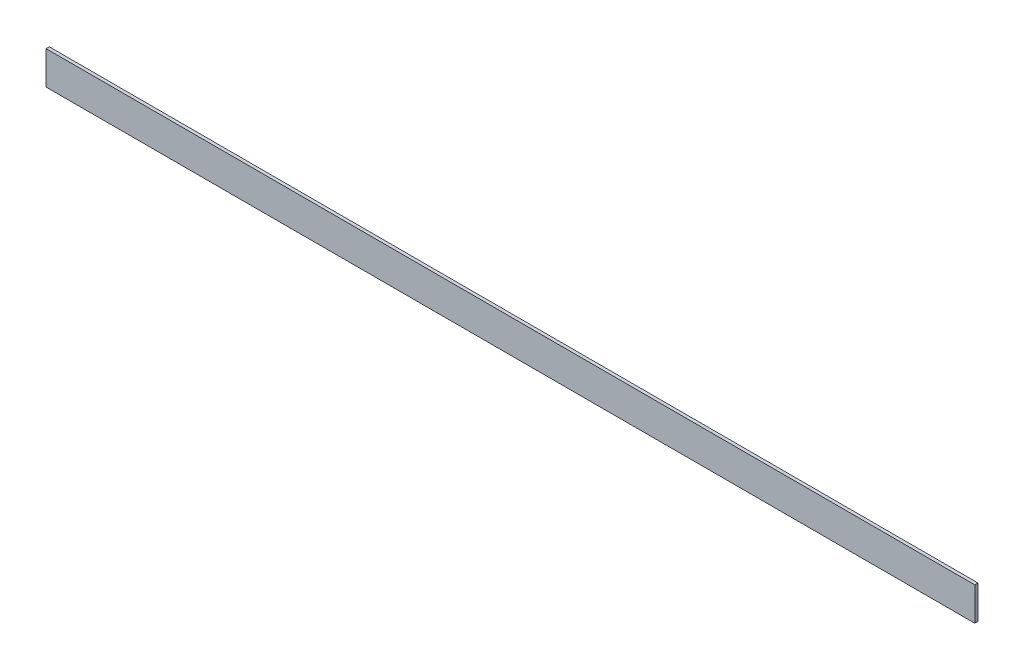
ISO-10303-21;
HEADER;
FILE_DESCRIPTION(('STEP AP214'),'2;1');
FILE_NAME('part.step','',(''),(''),'','','');
FILE_SCHEMA(('AUTOMOTIVE_DESIGN { 1 0 10303 214 1 1 1 1 }'));
ENDSEC;
DATA;
#1=APPLICATION_CONTEXT('core data for automotive mechanical design processes');
#2=APPLICATION_PROTOCOL_DEFINITION('international standard','automotive_design',2000,#1);
#3=PRODUCT_CONTEXT('',#1,'mechanical');
#4=PRODUCT('Part','Part','',(#3));
#5=PRODUCT_RELATED_PRODUCT_CATEGORY('part','',(#4));
#6=PRODUCT_DEFINITION_FORMATION('','',#4);
#7=PRODUCT_DEFINITION_CONTEXT('part definition',#1,'design');
#8=PRODUCT_DEFINITION('design','',#6,#7);
#9=PRODUCT_DEFINITION_SHAPE('','',#8);
#10=(LENGTH_UNIT() NAMED_UNIT(*) SI_UNIT(.MILLI.,.METRE.));
#11=(NAMED_UNIT(*) PLANE_ANGLE_UNIT() SI_UNIT($,.RADIAN.));
#12=(NAMED_UNIT(*) SI_UNIT($,.STERADIAN.) SOLID_ANGLE_UNIT());
#13=UNCERTAINTY_MEASURE_WITH_UNIT(LENGTH_MEASURE(1.E-05),#10,'distance_accuracy_value','');
#14=(GEOMETRIC_REPRESENTATION_CONTEXT(3) GLOBAL_UNCERTAINTY_ASSIGNED_CONTEXT((#13)) GLOBAL_UNIT_ASSIGNED_CONTEXT((#10,
#11,#12)) REPRESENTATION_CONTEXT('',''));
#15=CARTESIAN_POINT('',(0.,0.,0.));
#16=DIRECTION('',(0.,0.,1.));
#17=DIRECTION('',(1.,0.,0.));
#18=AXIS2_PLACEMENT_3D('',#15,#16,#17);
#19=CARTESIAN_POINT('',(0.,0.,3.175));
#20=DIRECTION('',(1.,0.,0.));
#21=DIRECTION('',(0.,0.,-1.));
#22=AXIS2_PLACEMENT_3D('',#19,#20,#21);
#23=PLANE('',#22);
#24=DIRECTION('',(0.,-1.,0.));
#25=VECTOR('',#24,1.);
#26=CARTESIAN_POINT('',(0.,0.,0.));
#27=LINE('',#26,#25);
#28=CARTESIAN_POINT('',(0.,33.,0.));
#29=VERTEX_POINT('',#28);
#30=CARTESIAN_POINT('',(0.,0.,0.));
#31=VERTEX_POINT('',#30);
#32=EDGE_CURVE('E96',#29,#31,#27,.T.);
#33=ORIENTED_EDGE('',*,*,#32,.T.);
#34=DIRECTION('',(0.,0.,-1.));
#35=VECTOR('',#34,1.);
#36=CARTESIAN_POINT('',(0.,0.,3.175));
#37=LINE('',#36,#35);
#38=CARTESIAN_POINT('',(0.,0.,3.175));
#39=VERTEX_POINT('',#38);
#40=EDGE_CURVE('E11',#39,#31,#37,.T.);
#41=ORIENTED_EDGE('',*,*,#40,.F.);
#42=DIRECTION('',(0.,-1.,0.));
#43=VECTOR('',#42,1.);
#44=CARTESIAN_POINT('',(0.,0.,3.175));
#45=LINE('',#44,#43);
#46=CARTESIAN_POINT('',(0.,33.,3.175));
#47=VERTEX_POINT('',#46);
#48=EDGE_CURVE('E84',#47,#39,#45,.T.);
#49=ORIENTED_EDGE('',*,*,#48,.F.);
#50=DIRECTION('',(0.,0.,-1.));
#51=VECTOR('',#50,1.);
#52=CARTESIAN_POINT('',(0.,33.,3.175));
#53=LINE('',#52,#51);
#54=EDGE_CURVE('E92',#47,#29,#53,.T.);
#55=ORIENTED_EDGE('',*,*,#54,.T.);
#56=EDGE_LOOP('',(#33,#41,#49,#55));
#57=FACE_BOUND('',#56,.T.);
#58=ADVANCED_FACE('F33',(#57),#23,.F.);
#59=CARTESIAN_POINT('',(0.,0.,3.175));
#60=DIRECTION('',(0.,1.,0.));
#61=DIRECTION('',(0.,0.,1.));
#62=AXIS2_PLACEMENT_3D('',#59,#60,#61);
#63=PLANE('',#62);
#64=DIRECTION('',(1.,0.,0.));
#65=VECTOR('',#64,1.);
#66=CARTESIAN_POINT('',(0.,0.,0.));
#67=LINE('',#66,#65);
#68=CARTESIAN_POINT('',(920.75,0.,0.));
#69=VERTEX_POINT('',#68);
#70=EDGE_CURVE('E88',#31,#69,#67,.T.);
#71=ORIENTED_EDGE('',*,*,#70,.T.);
#72=DIRECTION('',(0.,0.,-1.));
#73=VECTOR('',#72,1.);
#74=CARTESIAN_POINT('',(920.75,0.,3.175));
#75=LINE('',#74,#73);
#76=CARTESIAN_POINT('',(920.75,0.,3.175));
#77=VERTEX_POINT('',#76);
#78=EDGE_CURVE('E41',#77,#69,#75,.T.);
#79=ORIENTED_EDGE('',*,*,#78,.F.);
#80=DIRECTION('',(1.,0.,0.));
#81=VECTOR('',#80,1.);
#82=CARTESIAN_POINT('',(0.,0.,3.175));
#83=LINE('',#82,#81);
#84=EDGE_CURVE('E79',#39,#77,#83,.T.);
#85=ORIENTED_EDGE('',*,*,#84,.F.);
#86=ORIENTED_EDGE('',*,*,#40,.T.);
#87=EDGE_LOOP('',(#71,#79,#85,#86));
#88=FACE_BOUND('',#87,.T.);
#89=ADVANCED_FACE('F87',(#88),#63,.F.);
#90=CARTESIAN_POINT('',(920.75,0.,3.175));
#91=DIRECTION('',(-1.,0.,0.));
#92=DIRECTION('',(0.,0.,1.));
#93=AXIS2_PLACEMENT_3D('',#90,#91,#92);
#94=PLANE('',#93);
#95=DIRECTION('',(0.,1.,0.));
#96=VECTOR('',#95,1.);
#97=CARTESIAN_POINT('',(920.75,0.,0.));
#98=LINE('',#97,#96);
#99=CARTESIAN_POINT('',(920.75,33.,0.));
#100=VERTEX_POINT('',#99);
#101=EDGE_CURVE('E66',#69,#100,#98,.T.);
#102=ORIENTED_EDGE('',*,*,#101,.T.);
#103=DIRECTION('',(0.,0.,-1.));
#104=VECTOR('',#103,1.);
#105=CARTESIAN_POINT('',(920.75,33.,3.175));
#106=LINE('',#105,#104);
#107=CARTESIAN_POINT('',(920.75,33.,3.175));
#108=VERTEX_POINT('',#107);
#109=EDGE_CURVE('E89',#108,#100,#106,.T.);
#110=ORIENTED_EDGE('',*,*,#109,.F.);
#111=DIRECTION('',(0.,1.,0.));
#112=VECTOR('',#111,1.);
#113=CARTESIAN_POINT('',(920.75,0.,3.175));
#114=LINE('',#113,#112);
#115=EDGE_CURVE('E82',#77,#108,#114,.T.);
#116=ORIENTED_EDGE('',*,*,#115,.F.);
#117=ORIENTED_EDGE('',*,*,#78,.T.);
#118=EDGE_LOOP('',(#102,#110,#116,#117));
#119=FACE_BOUND('',#118,.T.);
#120=ADVANCED_FACE('F90',(#119),#94,.F.);
#121=CARTESIAN_POINT('',(0.,33.,3.175));
#122=DIRECTION('',(0.,-1.,0.));
#123=DIRECTION('',(0.,0.,-1.));
#124=AXIS2_PLACEMENT_3D('',#121,#122,#123);
#125=PLANE('',#124);
#126=DIRECTION('',(-1.,0.,0.));
#127=VECTOR('',#126,1.);
#128=CARTESIAN_POINT('',(0.,33.,0.));
#129=LINE('',#128,#127);
#130=EDGE_CURVE('E72',#100,#29,#129,.T.);
#131=ORIENTED_EDGE('',*,*,#130,.T.);
#132=ORIENTED_EDGE('',*,*,#54,.F.);
#133=DIRECTION('',(-1.,0.,0.));
#134=VECTOR('',#133,1.);
#135=CARTESIAN_POINT('',(0.,33.,3.175));
#136=LINE('',#135,#134);
#137=EDGE_CURVE('E49',#108,#47,#136,.T.);
#138=ORIENTED_EDGE('',*,*,#137,.F.);
#139=ORIENTED_EDGE('',*,*,#109,.T.);
#140=EDGE_LOOP('',(#131,#132,#138,#139));
#141=FACE_BOUND('',#140,.T.);
#142=ADVANCED_FACE('F103',(#141),#125,.F.);
#143=CARTESIAN_POINT('',(0.,0.,3.175));
#144=DIRECTION('',(0.,0.,-1.));
#145=DIRECTION('',(-1.,0.,0.));
#146=AXIS2_PLACEMENT_3D('',#143,#144,#145);
#147=PLANE('',#146);
#148=ORIENTED_EDGE('',*,*,#48,.T.);
#149=ORIENTED_EDGE('',*,*,#84,.T.);
#150=ORIENTED_EDGE('',*,*,#115,.T.);
#151=ORIENTED_EDGE('',*,*,#137,.T.);
#152=EDGE_LOOP('',(#148,#149,#150,#151));
#153=FACE_BOUND('',#152,.T.);
#154=ADVANCED_FACE('F80',(#153),#147,.F.);
#155=CARTESIAN_POINT('',(0.,0.,0.));
#156=DIRECTION('',(0.,0.,-1.));
#157=DIRECTION('',(-1.,0.,0.));
#158=AXIS2_PLACEMENT_3D('',#155,#156,#157);
#159=PLANE('',#158);
#160=ORIENTED_EDGE('',*,*,#32,.F.);
#161=ORIENTED_EDGE('',*,*,#130,.F.);
#162=ORIENTED_EDGE('',*,*,#101,.F.);
#163=ORIENTED_EDGE('',*,*,#70,.F.);
#164=EDGE_LOOP('',(#160,#161,#162,#163));
#165=FACE_BOUND('',#164,.T.);
#166=ADVANCED_FACE('F106',(#165),#159,.T.);
#167=CLOSED_SHELL('',(#58,#89,#120,#142,#154,#166));
#168=MANIFOLD_SOLID_BREP('B2',#167);
#169=ADVANCED_BREP_SHAPE_REPRESENTATION('',(#18,#168),#14);
#170=SHAPE_DEFINITION_REPRESENTATION(#9,#169);
ENDSEC;
END-ISO-10303-21;
